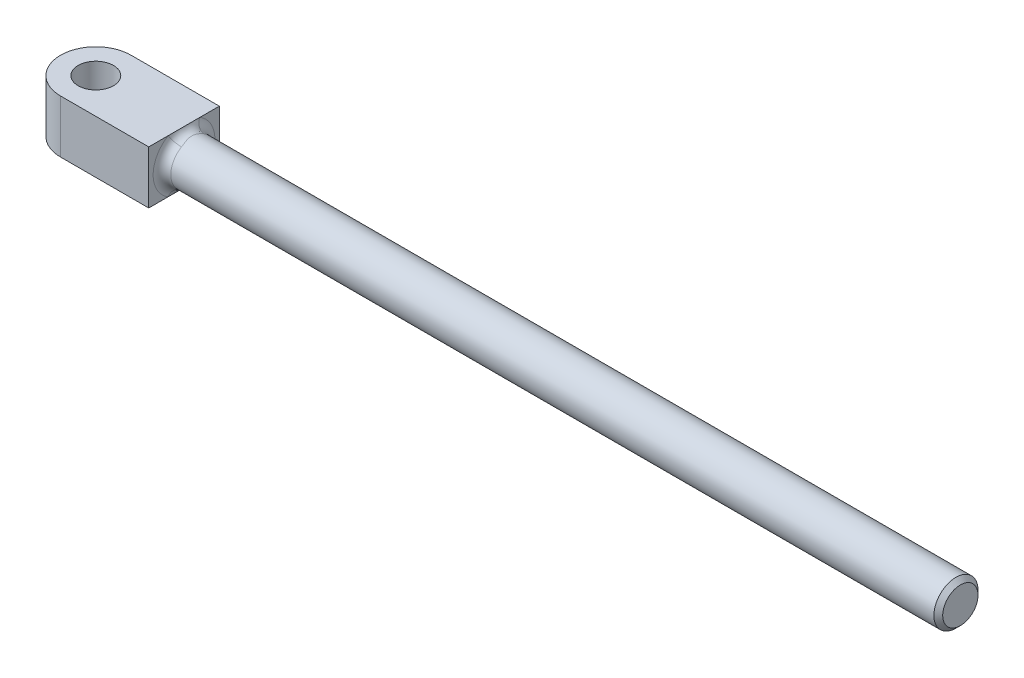
ISO-10303-21;
HEADER;
FILE_DESCRIPTION(('STEP AP214'),'2;1');
FILE_NAME('part.step','',(''),(''),'','','');
FILE_SCHEMA(('AUTOMOTIVE_DESIGN { 1 0 10303 214 1 1 1 1 }'));
ENDSEC;
DATA;
#1=APPLICATION_CONTEXT('core data for automotive mechanical design processes');
#2=APPLICATION_PROTOCOL_DEFINITION('international standard','automotive_design',2000,#1);
#3=PRODUCT_CONTEXT('',#1,'mechanical');
#4=PRODUCT('Part','Part','',(#3));
#5=PRODUCT_RELATED_PRODUCT_CATEGORY('part','',(#4));
#6=PRODUCT_DEFINITION_FORMATION('','',#4);
#7=PRODUCT_DEFINITION_CONTEXT('part definition',#1,'design');
#8=PRODUCT_DEFINITION('design','',#6,#7);
#9=PRODUCT_DEFINITION_SHAPE('','',#8);
#10=(LENGTH_UNIT() NAMED_UNIT(*) SI_UNIT(.MILLI.,.METRE.));
#11=(NAMED_UNIT(*) PLANE_ANGLE_UNIT() SI_UNIT($,.RADIAN.));
#12=(NAMED_UNIT(*) SI_UNIT($,.STERADIAN.) SOLID_ANGLE_UNIT());
#13=UNCERTAINTY_MEASURE_WITH_UNIT(LENGTH_MEASURE(1.E-05),#10,'distance_accuracy_value','');
#14=(GEOMETRIC_REPRESENTATION_CONTEXT(3) GLOBAL_UNCERTAINTY_ASSIGNED_CONTEXT((#13)) GLOBAL_UNIT_ASSIGNED_CONTEXT((#10,
#11,#12)) REPRESENTATION_CONTEXT('',''));
#15=CARTESIAN_POINT('',(0.,0.,0.));
#16=DIRECTION('',(0.,0.,1.));
#17=DIRECTION('',(1.,0.,0.));
#18=AXIS2_PLACEMENT_3D('',#15,#16,#17);
#19=CARTESIAN_POINT('',(-44.,3.,4.));
#20=DIRECTION('',(-1.,0.,0.));
#21=DIRECTION('',(0.,0.,1.));
#22=AXIS2_PLACEMENT_3D('',#19,#20,#21);
#23=PLANE('',#22);
#24=DIRECTION('',(0.,0.,-1.));
#25=VECTOR('',#24,1.);
#26=CARTESIAN_POINT('',(-44.,-3.,4.));
#27=LINE('',#26,#25);
#28=CARTESIAN_POINT('',(-44.,-3.,4.));
#29=VERTEX_POINT('',#28);
#30=CARTESIAN_POINT('',(-44.,-3.,1.802775637732));
#31=VERTEX_POINT('',#30);
#32=EDGE_CURVE('E249',#29,#31,#27,.T.);
#33=ORIENTED_EDGE('',*,*,#32,.T.);
#34=CARTESIAN_POINT('',(-44.,0.,0.));
#35=DIRECTION('',(-1.,0.,0.));
#36=DIRECTION('',(0.,0.,1.));
#37=AXIS2_PLACEMENT_3D('',#34,#35,#36);
#38=CIRCLE('',#37,3.5);
#39=CARTESIAN_POINT('',(-44.,3.,1.802775637732));
#40=VERTEX_POINT('',#39);
#41=EDGE_CURVE('E77',#31,#40,#38,.T.);
#42=ORIENTED_EDGE('',*,*,#41,.T.);
#43=DIRECTION('',(0.,0.,-1.));
#44=VECTOR('',#43,1.);
#45=CARTESIAN_POINT('',(-44.,3.,4.));
#46=LINE('',#45,#44);
#47=CARTESIAN_POINT('',(-44.,3.,4.));
#48=VERTEX_POINT('',#47);
#49=EDGE_CURVE('E129',#48,#40,#46,.T.);
#50=ORIENTED_EDGE('',*,*,#49,.F.);
#51=DIRECTION('',(0.,-1.,0.));
#52=VECTOR('',#51,1.);
#53=CARTESIAN_POINT('',(-44.,3.,4.));
#54=LINE('',#53,#52);
#55=EDGE_CURVE('E251',#48,#29,#54,.T.);
#56=ORIENTED_EDGE('',*,*,#55,.T.);
#57=EDGE_LOOP('',(#33,#42,#50,#56));
#58=FACE_BOUND('',#57,.T.);
#59=ADVANCED_FACE('F53',(#58),#23,.F.);
#60=CARTESIAN_POINT('',(44.,0.,0.));
#61=DIRECTION('',(-1.,0.,0.));
#62=DIRECTION('',(0.,0.,1.));
#63=AXIS2_PLACEMENT_3D('',#60,#61,#62);
#64=CYLINDRICAL_SURFACE('',#63,2.5);
#65=CARTESIAN_POINT('',(43.5,0.,0.));
#66=DIRECTION('',(1.,0.,0.));
#67=DIRECTION('',(0.,0.,-1.));
#68=AXIS2_PLACEMENT_3D('',#65,#66,#67);
#69=CIRCLE('',#68,2.5);
#70=CARTESIAN_POINT('',(43.5,0.,-2.5));
#71=VERTEX_POINT('',#70);
#72=EDGE_CURVE('E11',#71,#71,#69,.F.);
#73=ORIENTED_EDGE('',*,*,#72,.T.);
#74=EDGE_LOOP('',(#73));
#75=FACE_BOUND('',#74,.T.);
#76=CARTESIAN_POINT('',(-43.,0.,0.));
#77=DIRECTION('',(-1.,0.,0.));
#78=DIRECTION('',(0.,0.,1.));
#79=AXIS2_PLACEMENT_3D('',#76,#77,#78);
#80=CIRCLE('',#79,2.5);
#81=CARTESIAN_POINT('',(-43.,2.14285714285714,1.28769688409428));
#82=VERTEX_POINT('',#81);
#83=CARTESIAN_POINT('',(-43.,-2.14285714285714,1.28769688409428));
#84=VERTEX_POINT('',#83);
#85=EDGE_CURVE('E143',#82,#84,#80,.F.);
#86=ORIENTED_EDGE('',*,*,#85,.T.);
#87=CARTESIAN_POINT('',(-43.089797118085,-1.84702666727615,1.68478262407076));
#88=CARTESIAN_POINT('',(-44.4013055840775,-2.11805305184009,1.38765648288615));
#89=CARTESIAN_POINT('',(-44.,-3.,2.35869567369906));
#90=CARTESIAN_POINT('',(-43.0750365677151,-1.87021882017819,1.65936827293121));
#91=CARTESIAN_POINT('',(-44.3701378909476,-2.10409965880878,1.39485788528736));
#92=CARTESIAN_POINT('',(-44.,-3.,2.32311558212301));
#93=CARTESIAN_POINT('',(-43.0624960551256,-1.8931706547633,1.6331408793853));
#94=CARTESIAN_POINT('',(-44.3378304890208,-2.09472768310196,1.39873123079867));
#95=CARTESIAN_POINT('',(-44.,-3.,2.28639723116133));
#96=CARTESIAN_POINT('',(-43.0413121648804,-1.93827997476055,1.57933264082472));
#97=CARTESIAN_POINT('',(-44.2739687568214,-2.08398106756867,1.39974119365739));
#98=CARTESIAN_POINT('',(-44.,-3.,2.21106569716945));
#99=CARTESIAN_POINT('',(-43.0326604969719,-1.96043905638494,1.55175481528734));
#100=CARTESIAN_POINT('',(-44.2424003619311,-2.08237228525282,1.39707606759514));
#101=CARTESIAN_POINT('',(-44.,-3.,2.1724567414075));
#102=CARTESIAN_POINT('',(-43.0118107698363,-2.02490711609745,1.46788389797563));
#103=CARTESIAN_POINT('',(-44.153160239198,-2.08663625544711,1.38007393620703));
#104=CARTESIAN_POINT('',(-44.,-3.,2.05503745715556));
#105=CARTESIAN_POINT('',(-43.00440526438,-2.06575259890433,1.40985814870029));
#106=CARTESIAN_POINT('',(-44.0973752365874,-2.10056168474141,1.35734706621002));
#107=CARTESIAN_POINT('',(-44.,-3.,1.97380140817702));
#108=CARTESIAN_POINT('',(-42.996699571837,-2.166530781852,1.25280520925141));
#109=CARTESIAN_POINT('',(-43.971793247003,-2.1515106641981,1.27354998841386));
#110=CARTESIAN_POINT('',(-44.,-3.,1.75392729295748));
#111=CARTESIAN_POINT('',(-43.0038144970095,-2.222277809081,1.15097658677615));
#112=CARTESIAN_POINT('',(-43.9094620246063,-2.19733566368005,1.19776380716156));
#113=CARTESIAN_POINT('',(-44.,-3.,1.6113672214882));
#114=CARTESIAN_POINT('',(-43.0285142350657,-2.31925618416504,0.940546919485241));
#115=CARTESIAN_POINT('',(-43.8178292510465,-2.28776397044254,1.01589565420033));
#116=CARTESIAN_POINT('',(-44.,-3.,1.31676568727773));
#117=CARTESIAN_POINT('',(-43.0461778500175,-2.36037452380379,0.831900466571021));
#118=CARTESIAN_POINT('',(-43.7862845207067,-2.3331242401296,0.90981205141224));
#119=CARTESIAN_POINT('',(-44.,-3.,1.16466065319858));
#120=CARTESIAN_POINT('',(-43.0731582535501,-2.41171212801429,0.661443155926692));
#121=CARTESIAN_POINT('',(-43.7528917245329,-2.39215410620667,0.732933207563454));
#122=CARTESIAN_POINT('',(-44.,-3.,0.926020418297826));
#123=CARTESIAN_POINT('',(-43.0825522109005,-2.42742237789651,0.601243759095335));
#124=CARTESIAN_POINT('',(-43.7439634770233,-2.41075944684108,0.669088597459993));
#125=CARTESIAN_POINT('',(-44.,-3.,0.841741262734412));
#126=CARTESIAN_POINT('',(-43.0998403341181,-2.45432605473146,0.479742938974889));
#127=CARTESIAN_POINT('',(-43.7300358645077,-2.443038608103,0.538014598545577));
#128=CARTESIAN_POINT('',(-44.,-3.,0.671640114565408));
#129=CARTESIAN_POINT('',(-43.1077350515484,-2.46552114449967,0.418441930084279));
#130=CARTESIAN_POINT('',(-43.7249453148161,-2.45686188645873,0.470525326937753));
#131=CARTESIAN_POINT('',(-44.,-3.,0.585818702117689));
#132=CARTESIAN_POINT('',(-43.1207588796569,-2.48327432263301,0.295297174727497));
#133=CARTESIAN_POINT('',(-43.7174407917484,-2.47886682684453,0.333738205015865));
#134=CARTESIAN_POINT('',(-44.,-3.,0.413416044618795));
#135=CARTESIAN_POINT('',(-43.1259001064712,-2.48985276592177,0.233457043445522));
#136=CARTESIAN_POINT('',(-43.7149720886307,-2.48717845577119,0.264142380679048));
#137=CARTESIAN_POINT('',(-44.,-3.,0.326839860825487));
#138=CARTESIAN_POINT('',(-43.1326423774325,-2.49838093998099,0.109361414969603));
#139=CARTESIAN_POINT('',(-43.7118654798941,-2.49792896303268,0.124128201815217));
#140=CARTESIAN_POINT('',(-44.,-3.,0.153105980955885));
#141=CARTESIAN_POINT('',(-43.134243770003,-2.50033112630897,0.0471059592608403));
#142=CARTESIAN_POINT('',(-43.7112114325808,-2.5004215525342,0.0533690862009662));
#143=CARTESIAN_POINT('',(-44.,-3.,0.0659483429588452));
#144=CARTESIAN_POINT('',(-43.1336139067538,-2.49955575223616,-0.0809249677260562));
#145=CARTESIAN_POINT('',(-43.7114774751147,-2.4994348313836,-0.0917267287857017));
#146=CARTESIAN_POINT('',(-44.,-3.,-0.113294954809786));
#147=CARTESIAN_POINT('',(-43.1311586456095,-2.49655692159848,-0.146698507289078));
#148=CARTESIAN_POINT('',(-43.7124911460776,-2.49560052172952,-0.166438542504366));
#149=CARTESIAN_POINT('',(-44.,-3.,-0.205377910178918));
#150=CARTESIAN_POINT('',(-43.1224512074842,-2.48540146107993,-0.277672408532134));
#151=CARTESIAN_POINT('',(-43.716666788324,-2.48158959625074,-0.313859143066459));
#152=CARTESIAN_POINT('',(-44.,-3.,-0.388741371970783));
#153=CARTESIAN_POINT('',(-43.1161982583954,-2.47724378233975,-0.342872650919777));
#154=CARTESIAN_POINT('',(-43.7198536950069,-2.4713346985524,-0.386964129925139));
#155=CARTESIAN_POINT('',(-44.,-3.,-0.480021711384188));
#156=CARTESIAN_POINT('',(-43.0932464010228,-2.44504355931936,-0.537749623298525));
#157=CARTESIAN_POINT('',(-43.7342534174093,-2.4313991285767,-0.603266803000702));
#158=CARTESIAN_POINT('',(-44.,-3.,-0.752849472792719));
#159=CARTESIAN_POINT('',(-43.0723789849322,-2.4132798538366,-0.665936276663989));
#160=CARTESIAN_POINT('',(-43.7505706277765,-2.39210640783796,-0.74218606897693));
#161=CARTESIAN_POINT('',(-44.,-3.,-0.932310787375758));
#162=CARTESIAN_POINT('',(-43.0325989277867,-2.32918194316108,-0.918065057160666));
#163=CARTESIAN_POINT('',(-43.8098708915164,-2.29892237927612,-0.995192101211795));
#164=CARTESIAN_POINT('',(-44.,-3.,-1.28529107997799));
#165=CARTESIAN_POINT('',(-43.01372459553,-2.27651421506208,-1.04190105099424));
#166=CARTESIAN_POINT('',(-43.8552965844584,-2.24305314597982,-1.11025639067921));
#167=CARTESIAN_POINT('',(-44.,-3.,-1.45866147138325));
#168=CARTESIAN_POINT('',(-43.0006561131893,-2.18316948515406,-1.21991874616671));
#169=CARTESIAN_POINT('',(-43.9527001394436,-2.16884641960792,-1.24485988487911));
#170=CARTESIAN_POINT('',(-44.,-3.,-1.70788624463769));
#171=CARTESIAN_POINT('',(-42.9988115884042,-2.14987102325299,-1.27769153842259));
#172=CARTESIAN_POINT('',(-43.9914812930602,-2.14508379161499,-1.28423049414727));
#173=CARTESIAN_POINT('',(-44.,-3.,-1.78876815379298));
#174=CARTESIAN_POINT('',(-43.0027809524236,-2.07884509209169,-1.3902589940265));
#175=CARTESIAN_POINT('',(-44.0802128203743,-2.10631330259421,-1.34781643223736));
#176=CARTESIAN_POINT('',(-44.,-3.,-1.94636259163618));
#177=CARTESIAN_POINT('',(-43.0085821638041,-2.04112504867186,-1.44505843077802));
#178=CARTESIAN_POINT('',(-44.1308276829839,-2.09160274518386,-1.37150981875896));
#179=CARTESIAN_POINT('',(-44.,-3.,-2.02308180308899));
#180=CARTESIAN_POINT('',(-43.0287135788627,-1.96987321995234,-1.54025161223538));
#181=CARTESIAN_POINT('',(-44.2293462180589,-2.081200774338,-1.39659640419796));
#182=CARTESIAN_POINT('',(-44.,-3.,-2.15635225712972));
#183=CARTESIAN_POINT('',(-43.0411101719168,-1.93700833370553,-1.5813374440865));
#184=CARTESIAN_POINT('',(-44.2764809877482,-2.08277430752351,-1.40104255573381));
#185=CARTESIAN_POINT('',(-44.,-3.,-2.2138724217212));
#186=CARTESIAN_POINT('',(-43.0748140684746,-1.86941106524605,-1.66075648332887));
#187=CARTESIAN_POINT('',(-44.3718312861369,-2.10297416756328,-1.39609191158888));
#188=CARTESIAN_POINT('',(-44.,-3.,-2.32505907666032));
#189=CARTESIAN_POINT('',(-43.0962198088155,-1.83466186451647,-1.69905362584829));
#190=CARTESIAN_POINT('',(-44.4200246778576,-2.12254536468005,-1.38591811782259));
#191=CARTESIAN_POINT('',(-44.,-3.,-2.37867507618741));
#192=CARTESIAN_POINT('',(-43.1230308972261,-1.79960945399659,-1.73534025859083));
#193=CARTESIAN_POINT('',(-44.4637953692633,-2.15360119143181,-1.36823825990707));
#194=CARTESIAN_POINT('',(-44.,-3.,-2.42947636202717));
#195=(BOUNDED_SURFACE() B_SPLINE_SURFACE(3,2,((#87,#88,#89),(#90,#91,#92),(#93,#94,#95),(#96,
#97,#98),(#99,#100,#101),(#102,#103,#104),(#105,#106,#107),(#108,#109,#110),(#111,#112,#113),
(#114,#115,#116),(#117,#118,#119),(#120,#121,#122),(#123,#124,#125),(#126,#127,#128),(#129,#130,
#131),(#132,#133,#134),(#135,#136,#137),(#138,#139,#140),(#141,#142,#143),(#144,#145,#146),
(#147,#148,#149),(#150,#151,#152),(#153,#154,#155),(#156,#157,#158),(#159,#160,#161),(#162,#163,
#164),(#165,#166,#167),(#168,#169,#170),(#171,#172,#173),(#174,#175,#176),(#177,#178,#179),
(#180,#181,#182),(#183,#184,#185),(#186,#187,#188),(#189,#190,#191),(#192,#193,#194)),
.UNSPECIFIED.,.F.,.F.,.F.) B_SPLINE_SURFACE_WITH_KNOTS((4,2,2,2,2,2,2,2,2,2,2,2,2,2,2,2,2,4),(3,
3),(0.,0.150978452111827,0.301633503365177,0.599468504271155,1.08493079559653,1.57406582227361,
1.83667758241673,2.09919254100671,2.36054266600821,2.62186706535215,2.8981091770013,
3.17440747024344,3.73017973784791,4.29520076320607,4.57485505395896,4.85404623174449,
5.07750820983562,5.30347792971453),(0.,1.),
.UNSPECIFIED.) GEOMETRIC_REPRESENTATION_ITEM() RATIONAL_B_SPLINE_SURFACE(((1.,0.589072238635042,
1.),(1.,0.59762198167987,1.),(1.,0.606281072137651,1.),(1.,0.623622640940451,1.),(1.,
0.632305029457278,1.),(1.,0.657952795370197,1.),(1.,0.674723639585426,1.),(1.,0.716899899837881,
1.),(1.,0.741089115601713,1.),(1.,0.783806931119421,1.),(1.,0.80229132133743,1.),(1.,
0.825548340664818,1.),(1.,0.832706660558896,1.),(1.,0.84500393829057,1.),(1.,0.85014363951437,
1.),(1.,0.858307963303755,1.),(1.,0.861341869719556,1.),(1.,0.865276991795518,1.),(1.,
0.866178417354906,1.),(1.,0.865820137657809,1.),(1.,0.864434126698027,1.),(1.,0.859289909346189,
1.),(1.,0.855531220558886,1.),(1.,0.840741031559034,1.),(1.,0.826198716210332,1.),(1.,
0.788270185201532,1.),(1.,0.764740823018135,1.),(1.,0.724264523444217,1.),(1.,0.709994983454132,
1.),(1.,0.680153160391977,1.),(1.,0.66458307382069,1.),(1.,0.635979859402365,1.),(1.,
0.623060704128199,1.),(1.,0.597254296383167,1.),(1.,0.584369028951344,1.),(1.,0.571874723989388,1.))) REPRESENTATION_ITEM('') SURFACE());
#196=CARTESIAN_POINT('',(-43.089797118085,-1.84702666727615,1.68478262407076));
#197=CARTESIAN_POINT('',(-43.0750365677151,-1.87021882017819,1.65936827293121));
#198=CARTESIAN_POINT('',(-43.0624960551256,-1.8931706547633,1.6331408793853));
#199=CARTESIAN_POINT('',(-43.0413121648804,-1.93827997476055,1.57933264082472));
#200=CARTESIAN_POINT('',(-43.0326604969719,-1.96043905638494,1.55175481528734));
#201=CARTESIAN_POINT('',(-43.0118107698362,-2.02490711609745,1.46788389797563));
#202=CARTESIAN_POINT('',(-43.00440526438,-2.06575259890433,1.40985814870029));
#203=CARTESIAN_POINT('',(-42.996699571837,-2.166530781852,1.25280520925141));
#204=CARTESIAN_POINT('',(-43.0038144970095,-2.222277809081,1.15097658677615));
#205=CARTESIAN_POINT('',(-43.0285142350657,-2.31925618416504,0.940546919485241));
#206=CARTESIAN_POINT('',(-43.0461778500175,-2.36037452380379,0.831900466571021));
#207=CARTESIAN_POINT('',(-43.0731582535501,-2.41171212801429,0.661443155926692));
#208=CARTESIAN_POINT('',(-43.0825522109005,-2.42742237789651,0.601243759095335));
#209=CARTESIAN_POINT('',(-43.0998403341181,-2.45432605473146,0.479742938974889));
#210=CARTESIAN_POINT('',(-43.1077350515484,-2.46552114449967,0.418441930084279));
#211=CARTESIAN_POINT('',(-43.1207588796569,-2.48327432263301,0.295297174727497));
#212=CARTESIAN_POINT('',(-43.1259001064712,-2.48985276592177,0.233457043445522));
#213=CARTESIAN_POINT('',(-43.1326423774325,-2.49838093998099,0.109361414969603));
#214=CARTESIAN_POINT('',(-43.134243770003,-2.50033112630897,0.0471059592608402));
#215=CARTESIAN_POINT('',(-43.1336139067538,-2.49955575223616,-0.0809249677260563));
#216=CARTESIAN_POINT('',(-43.1311586456095,-2.49655692159848,-0.146698507289078));
#217=CARTESIAN_POINT('',(-43.1224512074842,-2.48540146107993,-0.277672408532134));
#218=CARTESIAN_POINT('',(-43.1161982583954,-2.47724378233976,-0.342872650919777));
#219=CARTESIAN_POINT('',(-43.0932464010228,-2.44504355931936,-0.537749623298525));
#220=CARTESIAN_POINT('',(-43.0723789849322,-2.4132798538366,-0.665936276663989));
#221=CARTESIAN_POINT('',(-43.0325989277867,-2.32918194316108,-0.918065057160667));
#222=CARTESIAN_POINT('',(-43.01372459553,-2.27651421506208,-1.04190105099424));
#223=CARTESIAN_POINT('',(-43.0006561131893,-2.18316948515406,-1.21991874616671));
#224=CARTESIAN_POINT('',(-42.9988115884042,-2.14987102325299,-1.27769153842259));
#225=CARTESIAN_POINT('',(-43.0027809524236,-2.07884509209169,-1.3902589940265));
#226=CARTESIAN_POINT('',(-43.0085821638041,-2.04112504867186,-1.44505843077802));
#227=CARTESIAN_POINT('',(-43.0287135788627,-1.96987321995234,-1.54025161223538));
#228=CARTESIAN_POINT('',(-43.0411101719168,-1.93700833370553,-1.5813374440865));
#229=CARTESIAN_POINT('',(-43.0748140684746,-1.86941106524605,-1.66075648332887));
#230=CARTESIAN_POINT('',(-43.0962198088155,-1.83466186451647,-1.69905362584829));
#231=CARTESIAN_POINT('',(-43.1230308972261,-1.79960945399659,-1.73534025859083));
#232=B_SPLINE_CURVE_WITH_KNOTS('',3,(#196,#197,#198,#199,#200,#201,#202,#203,#204,#205,#206,
#207,#208,#209,#210,#211,#212,#213,#214,#215,#216,#217,#218,#219,#220,#221,#222,#223,#224,#225,
#226,#227,#228,#229,#230,#231),.UNSPECIFIED.,.F.,.F.,(4,2,2,2,2,2,2,2,2,2,2,2,2,2,2,2,2,4),(0.,
0.150978452111827,0.301633503365177,0.599468504271155,1.08493079559653,1.57406582227361,
1.83667758241673,2.09919254100671,2.36054266600821,2.62186706535215,2.8981091770013,
3.17440747024344,3.73017973784791,4.29520076320607,4.57485505395896,4.85404623174449,
5.07750820983562,5.30347792971453),.UNSPECIFIED.);
#233=CARTESIAN_POINT('',(-43.,-2.14285714285714,-1.28769688409428));
#234=VERTEX_POINT('',#233);
#235=EDGE_CURVE('E197',#84,#234,#232,.T.);
#236=ORIENTED_EDGE('',*,*,#235,.T.);
#237=CARTESIAN_POINT('',(-43.,0.,0.));
#238=DIRECTION('',(-1.,0.,0.));
#239=DIRECTION('',(0.,0.,1.));
#240=AXIS2_PLACEMENT_3D('',#237,#238,#239);
#241=CIRCLE('',#240,2.5);
#242=CARTESIAN_POINT('',(-43.,2.14285714285714,-1.28769688409428));
#243=VERTEX_POINT('',#242);
#244=EDGE_CURVE('E158',#234,#243,#241,.F.);
#245=ORIENTED_EDGE('',*,*,#244,.T.);
#246=CARTESIAN_POINT('',(-43.089797118085,1.84702666727615,-1.68478262407076));
#247=CARTESIAN_POINT('',(-44.4013055840775,2.11805305184009,-1.38765648288615));
#248=CARTESIAN_POINT('',(-44.,3.,-2.35869567369906));
#249=CARTESIAN_POINT('',(-43.0750365677151,1.87021882017819,-1.65936827293121));
#250=CARTESIAN_POINT('',(-44.3701378909476,2.10409965880878,-1.39485788528736));
#251=CARTESIAN_POINT('',(-44.,3.,-2.323115582123));
#252=CARTESIAN_POINT('',(-43.0624960551256,1.8931706547633,-1.6331408793853));
#253=CARTESIAN_POINT('',(-44.3378304890208,2.09472768310196,-1.39873123079867));
#254=CARTESIAN_POINT('',(-44.,3.,-2.28639723116133));
#255=CARTESIAN_POINT('',(-43.0413121648804,1.93827997476055,-1.57933264082472));
#256=CARTESIAN_POINT('',(-44.2739687568214,2.08398106756867,-1.39974119365739));
#257=CARTESIAN_POINT('',(-44.,3.,-2.21106569716945));
#258=CARTESIAN_POINT('',(-43.0326604969719,1.96043905638494,-1.55175481528734));
#259=CARTESIAN_POINT('',(-44.2424003619311,2.08237228525282,-1.39707606759514));
#260=CARTESIAN_POINT('',(-44.,3.,-2.1724567414075));
#261=CARTESIAN_POINT('',(-43.0118107698363,2.02490711609745,-1.46788389797563));
#262=CARTESIAN_POINT('',(-44.153160239198,2.08663625544711,-1.38007393620703));
#263=CARTESIAN_POINT('',(-44.,3.,-2.05503745715557));
#264=CARTESIAN_POINT('',(-43.00440526438,2.06575259890433,-1.40985814870029));
#265=CARTESIAN_POINT('',(-44.0973752365874,2.10056168474141,-1.35734706621002));
#266=CARTESIAN_POINT('',(-44.,3.,-1.97380140817702));
#267=CARTESIAN_POINT('',(-42.996699571837,2.166530781852,-1.25280520925141));
#268=CARTESIAN_POINT('',(-43.971793247003,2.1515106641981,-1.27354998841386));
#269=CARTESIAN_POINT('',(-44.,3.,-1.75392729295748));
#270=CARTESIAN_POINT('',(-43.0038144970095,2.222277809081,-1.15097658677615));
#271=CARTESIAN_POINT('',(-43.9094620246063,2.19733566368005,-1.19776380716156));
#272=CARTESIAN_POINT('',(-44.,3.,-1.6113672214882));
#273=CARTESIAN_POINT('',(-43.0285142350657,2.31925618416504,-0.940546919485241));
#274=CARTESIAN_POINT('',(-43.8178292510465,2.28776397044254,-1.01589565420033));
#275=CARTESIAN_POINT('',(-44.,3.,-1.31676568727773));
#276=CARTESIAN_POINT('',(-43.0461778500175,2.36037452380379,-0.831900466571021));
#277=CARTESIAN_POINT('',(-43.7862845207067,2.3331242401296,-0.90981205141224));
#278=CARTESIAN_POINT('',(-44.,3.,-1.16466065319858));
#279=CARTESIAN_POINT('',(-43.0731582535501,2.41171212801429,-0.661443155926692));
#280=CARTESIAN_POINT('',(-43.7528917245329,2.39215410620667,-0.732933207563455));
#281=CARTESIAN_POINT('',(-44.,3.,-0.926020418297826));
#282=CARTESIAN_POINT('',(-43.0825522109005,2.42742237789651,-0.601243759095335));
#283=CARTESIAN_POINT('',(-43.7439634770233,2.41075944684108,-0.669088597459993));
#284=CARTESIAN_POINT('',(-44.,3.,-0.841741262734412));
#285=CARTESIAN_POINT('',(-43.0998403341181,2.45432605473146,-0.479742938974889));
#286=CARTESIAN_POINT('',(-43.7300358645077,2.443038608103,-0.538014598545577));
#287=CARTESIAN_POINT('',(-44.,3.,-0.671640114565408));
#288=CARTESIAN_POINT('',(-43.1077350515484,2.46552114449967,-0.418441930084279));
#289=CARTESIAN_POINT('',(-43.7249453148161,2.45686188645873,-0.470525326937753));
#290=CARTESIAN_POINT('',(-44.,3.,-0.585818702117689));
#291=CARTESIAN_POINT('',(-43.1207588796569,2.48327432263301,-0.295297174727497));
#292=CARTESIAN_POINT('',(-43.7174407917484,2.47886682684453,-0.333738205015865));
#293=CARTESIAN_POINT('',(-44.,3.,-0.413416044618796));
#294=CARTESIAN_POINT('',(-43.1259001064712,2.48985276592177,-0.233457043445522));
#295=CARTESIAN_POINT('',(-43.7149720886307,2.48717845577119,-0.264142380679048));
#296=CARTESIAN_POINT('',(-44.,3.,-0.326839860825487));
#297=CARTESIAN_POINT('',(-43.1326423774325,2.49838093998099,-0.109361414969603));
#298=CARTESIAN_POINT('',(-43.7118654798941,2.49792896303268,-0.124128201815217));
#299=CARTESIAN_POINT('',(-44.,3.,-0.153105980955885));
#300=CARTESIAN_POINT('',(-43.134243770003,2.50033112630897,-0.0471059592608403));
#301=CARTESIAN_POINT('',(-43.7112114325808,2.5004215525342,-0.0533690862009662));
#302=CARTESIAN_POINT('',(-44.,3.,-0.0659483429588452));
#303=CARTESIAN_POINT('',(-43.1336139067538,2.49955575223616,0.0809249677260562));
#304=CARTESIAN_POINT('',(-43.7114774751147,2.4994348313836,0.0917267287857017));
#305=CARTESIAN_POINT('',(-44.,3.,0.113294954809786));
#306=CARTESIAN_POINT('',(-43.1311586456095,2.49655692159848,0.146698507289078));
#307=CARTESIAN_POINT('',(-43.7124911460776,2.49560052172952,0.166438542504366));
#308=CARTESIAN_POINT('',(-44.,3.,0.205377910178918));
#309=CARTESIAN_POINT('',(-43.1224512074842,2.48540146107993,0.277672408532134));
#310=CARTESIAN_POINT('',(-43.716666788324,2.48158959625074,0.313859143066459));
#311=CARTESIAN_POINT('',(-44.,3.,0.388741371970783));
#312=CARTESIAN_POINT('',(-43.1161982583954,2.47724378233975,0.342872650919777));
#313=CARTESIAN_POINT('',(-43.7198536950069,2.4713346985524,0.386964129925139));
#314=CARTESIAN_POINT('',(-44.,3.,0.480021711384188));
#315=CARTESIAN_POINT('',(-43.0932464010228,2.44504355931936,0.537749623298525));
#316=CARTESIAN_POINT('',(-43.7342534174093,2.4313991285767,0.603266803000702));
#317=CARTESIAN_POINT('',(-44.,3.,0.752849472792719));
#318=CARTESIAN_POINT('',(-43.0723789849322,2.4132798538366,0.665936276663989));
#319=CARTESIAN_POINT('',(-43.7505706277765,2.39210640783796,0.742186068976931));
#320=CARTESIAN_POINT('',(-44.,3.,0.932310787375759));
#321=CARTESIAN_POINT('',(-43.0325989277867,2.32918194316108,0.918065057160666));
#322=CARTESIAN_POINT('',(-43.8098708915164,2.29892237927612,0.995192101211795));
#323=CARTESIAN_POINT('',(-44.,3.,1.28529107997799));
#324=CARTESIAN_POINT('',(-43.01372459553,2.27651421506208,1.04190105099424));
#325=CARTESIAN_POINT('',(-43.8552965844584,2.24305314597982,1.11025639067921));
#326=CARTESIAN_POINT('',(-44.,3.,1.45866147138325));
#327=CARTESIAN_POINT('',(-43.0006561131893,2.18316948515406,1.21991874616671));
#328=CARTESIAN_POINT('',(-43.9527001394436,2.16884641960792,1.24485988487911));
#329=CARTESIAN_POINT('',(-44.,3.,1.70788624463769));
#330=CARTESIAN_POINT('',(-42.9988115884042,2.14987102325299,1.27769153842259));
#331=CARTESIAN_POINT('',(-43.9914812930602,2.14508379161499,1.28423049414727));
#332=CARTESIAN_POINT('',(-44.,3.,1.78876815379298));
#333=CARTESIAN_POINT('',(-43.0027809524236,2.07884509209169,1.3902589940265));
#334=CARTESIAN_POINT('',(-44.0802128203743,2.10631330259421,1.34781643223736));
#335=CARTESIAN_POINT('',(-44.,3.,1.94636259163618));
#336=CARTESIAN_POINT('',(-43.0085821638041,2.04112504867186,1.44505843077802));
#337=CARTESIAN_POINT('',(-44.1308276829839,2.09160274518386,1.37150981875896));
#338=CARTESIAN_POINT('',(-44.,3.,2.02308180308899));
#339=CARTESIAN_POINT('',(-43.0287135788627,1.96987321995234,1.54025161223538));
#340=CARTESIAN_POINT('',(-44.2293462180589,2.081200774338,1.39659640419796));
#341=CARTESIAN_POINT('',(-44.,3.,2.15635225712972));
#342=CARTESIAN_POINT('',(-43.0411101719168,1.93700833370553,1.5813374440865));
#343=CARTESIAN_POINT('',(-44.2764809877482,2.08277430752351,1.40104255573381));
#344=CARTESIAN_POINT('',(-44.,3.,2.2138724217212));
#345=CARTESIAN_POINT('',(-43.0748140684746,1.86941106524605,1.66075648332887));
#346=CARTESIAN_POINT('',(-44.3718312861369,2.10297416756328,1.39609191158888));
#347=CARTESIAN_POINT('',(-44.,3.,2.32505907666032));
#348=CARTESIAN_POINT('',(-43.0962198088155,1.83466186451647,1.69905362584829));
#349=CARTESIAN_POINT('',(-44.4200246778576,2.12254536468005,1.38591811782259));
#350=CARTESIAN_POINT('',(-44.,3.,2.37867507618741));
#351=CARTESIAN_POINT('',(-43.1230308972261,1.79960945399659,1.73534025859083));
#352=CARTESIAN_POINT('',(-44.4637953692633,2.15360119143181,1.36823825990707));
#353=CARTESIAN_POINT('',(-44.,3.,2.42947636202717));
#354=(BOUNDED_SURFACE() B_SPLINE_SURFACE(3,2,((#246,#247,#248),(#249,#250,#251),(#252,#253,
#254),(#255,#256,#257),(#258,#259,#260),(#261,#262,#263),(#264,#265,#266),(#267,#268,#269),
(#270,#271,#272),(#273,#274,#275),(#276,#277,#278),(#279,#280,#281),(#282,#283,#284),(#285,#286,
#287),(#288,#289,#290),(#291,#292,#293),(#294,#295,#296),(#297,#298,#299),(#300,#301,#302),
(#303,#304,#305),(#306,#307,#308),(#309,#310,#311),(#312,#313,#314),(#315,#316,#317),(#318,#319,
#320),(#321,#322,#323),(#324,#325,#326),(#327,#328,#329),(#330,#331,#332),(#333,#334,#335),
(#336,#337,#338),(#339,#340,#341),(#342,#343,#344),(#345,#346,#347),(#348,#349,#350),(#351,#352,
#353)),.UNSPECIFIED.,.F.,.F.,.F.) B_SPLINE_SURFACE_WITH_KNOTS((4,2,2,2,2,2,2,2,2,2,2,2,2,2,2,2,
2,4),(3,3),(0.,0.150978452111827,0.301633503365177,0.599468504271155,1.08493079559653,
1.57406582227361,1.83667758241673,2.09919254100671,2.36054266600821,2.62186706535215,
2.8981091770013,3.17440747024344,3.73017973784791,4.29520076320607,4.57485505395896,
4.85404623174449,5.07750820983562,5.30347792971453),(0.,1.),
.UNSPECIFIED.) GEOMETRIC_REPRESENTATION_ITEM() RATIONAL_B_SPLINE_SURFACE(((1.,0.589072238635042,
1.),(1.,0.59762198167987,1.),(1.,0.606281072137652,1.),(1.,0.623622640940451,1.),(1.,
0.632305029457278,1.),(1.,0.657952795370197,1.),(1.,0.674723639585426,1.),(1.,0.716899899837881,
1.),(1.,0.741089115601713,1.),(1.,0.783806931119421,1.),(1.,0.80229132133743,1.),(1.,
0.825548340664818,1.),(1.,0.832706660558896,1.),(1.,0.84500393829057,1.),(1.,0.85014363951437,
1.),(1.,0.858307963303755,1.),(1.,0.861341869719556,1.),(1.,0.865276991795518,1.),(1.,
0.866178417354906,1.),(1.,0.865820137657809,1.),(1.,0.864434126698027,1.),(1.,0.859289909346189,
1.),(1.,0.855531220558886,1.),(1.,0.840741031559034,1.),(1.,0.826198716210332,1.),(1.,
0.788270185201532,1.),(1.,0.764740823018135,1.),(1.,0.724264523444217,1.),(1.,0.709994983454132,
1.),(1.,0.680153160391977,1.),(1.,0.66458307382069,1.),(1.,0.635979859402365,1.),(1.,
0.623060704128199,1.),(1.,0.597254296383167,1.),(1.,0.584369028951344,1.),(1.,0.571874723989388,1.))) REPRESENTATION_ITEM('') SURFACE());
#355=CARTESIAN_POINT('',(-43.089797118085,1.84702666727615,-1.68478262407076));
#356=CARTESIAN_POINT('',(-43.0750365677151,1.87021882017819,-1.65936827293121));
#357=CARTESIAN_POINT('',(-43.0624960551256,1.8931706547633,-1.6331408793853));
#358=CARTESIAN_POINT('',(-43.0413121648804,1.93827997476055,-1.57933264082472));
#359=CARTESIAN_POINT('',(-43.0326604969719,1.96043905638494,-1.55175481528734));
#360=CARTESIAN_POINT('',(-43.0118107698362,2.02490711609745,-1.46788389797563));
#361=CARTESIAN_POINT('',(-43.00440526438,2.06575259890433,-1.40985814870029));
#362=CARTESIAN_POINT('',(-42.996699571837,2.166530781852,-1.25280520925141));
#363=CARTESIAN_POINT('',(-43.0038144970095,2.222277809081,-1.15097658677615));
#364=CARTESIAN_POINT('',(-43.0285142350657,2.31925618416504,-0.940546919485241));
#365=CARTESIAN_POINT('',(-43.0461778500175,2.36037452380379,-0.831900466571021));
#366=CARTESIAN_POINT('',(-43.0731582535501,2.41171212801429,-0.661443155926692));
#367=CARTESIAN_POINT('',(-43.0825522109005,2.42742237789651,-0.601243759095335));
#368=CARTESIAN_POINT('',(-43.0998403341181,2.45432605473146,-0.479742938974889));
#369=CARTESIAN_POINT('',(-43.1077350515484,2.46552114449967,-0.418441930084279));
#370=CARTESIAN_POINT('',(-43.1207588796569,2.48327432263301,-0.295297174727497));
#371=CARTESIAN_POINT('',(-43.1259001064712,2.48985276592177,-0.233457043445522));
#372=CARTESIAN_POINT('',(-43.1326423774325,2.49838093998099,-0.109361414969603));
#373=CARTESIAN_POINT('',(-43.134243770003,2.50033112630897,-0.0471059592608402));
#374=CARTESIAN_POINT('',(-43.1336139067538,2.49955575223616,0.0809249677260563));
#375=CARTESIAN_POINT('',(-43.1311586456095,2.49655692159848,0.146698507289078));
#376=CARTESIAN_POINT('',(-43.1224512074842,2.48540146107993,0.277672408532134));
#377=CARTESIAN_POINT('',(-43.1161982583954,2.47724378233976,0.342872650919777));
#378=CARTESIAN_POINT('',(-43.0932464010228,2.44504355931936,0.537749623298525));
#379=CARTESIAN_POINT('',(-43.0723789849322,2.4132798538366,0.665936276663989));
#380=CARTESIAN_POINT('',(-43.0325989277867,2.32918194316108,0.918065057160667));
#381=CARTESIAN_POINT('',(-43.01372459553,2.27651421506208,1.04190105099424));
#382=CARTESIAN_POINT('',(-43.0006561131893,2.18316948515406,1.21991874616671));
#383=CARTESIAN_POINT('',(-42.9988115884042,2.14987102325299,1.27769153842259));
#384=CARTESIAN_POINT('',(-43.0027809524236,2.07884509209169,1.3902589940265));
#385=CARTESIAN_POINT('',(-43.0085821638041,2.04112504867186,1.44505843077802));
#386=CARTESIAN_POINT('',(-43.0287135788627,1.96987321995234,1.54025161223538));
#387=CARTESIAN_POINT('',(-43.0411101719168,1.93700833370553,1.5813374440865));
#388=CARTESIAN_POINT('',(-43.0748140684746,1.86941106524605,1.66075648332887));
#389=CARTESIAN_POINT('',(-43.0962198088155,1.83466186451647,1.69905362584829));
#390=CARTESIAN_POINT('',(-43.1230308972261,1.79960945399659,1.73534025859083));
#391=B_SPLINE_CURVE_WITH_KNOTS('',3,(#355,#356,#357,#358,#359,#360,#361,#362,#363,#364,#365,
#366,#367,#368,#369,#370,#371,#372,#373,#374,#375,#376,#377,#378,#379,#380,#381,#382,#383,#384,
#385,#386,#387,#388,#389,#390),.UNSPECIFIED.,.F.,.F.,(4,2,2,2,2,2,2,2,2,2,2,2,2,2,2,2,2,4),(0.,
0.150978452111827,0.301633503365177,0.599468504271155,1.08493079559653,1.57406582227361,
1.83667758241673,2.09919254100671,2.36054266600821,2.62186706535215,2.8981091770013,
3.17440747024344,3.73017973784791,4.29520076320607,4.57485505395896,4.85404623174449,
5.07750820983562,5.30347792971453),.UNSPECIFIED.);
#392=EDGE_CURVE('E145',#243,#82,#391,.T.);
#393=ORIENTED_EDGE('',*,*,#392,.T.);
#394=EDGE_LOOP('',(#86,#236,#245,#393));
#395=FACE_BOUND('',#394,.T.);
#396=ADVANCED_FACE('F160',(#75,#395),#64,.T.);
#397=CARTESIAN_POINT('',(44.,0.,0.));
#398=DIRECTION('',(1.,0.,0.));
#399=DIRECTION('',(0.,0.,-1.));
#400=AXIS2_PLACEMENT_3D('',#397,#398,#399);
#401=PLANE('',#400);
#402=CARTESIAN_POINT('',(44.,0.,0.));
#403=DIRECTION('',(1.,0.,0.));
#404=DIRECTION('',(0.,0.,-1.));
#405=AXIS2_PLACEMENT_3D('',#402,#403,#404);
#406=CIRCLE('',#405,2.);
#407=CARTESIAN_POINT('',(44.,0.,-2.));
#408=VERTEX_POINT('',#407);
#409=EDGE_CURVE('E62',#408,#408,#406,.T.);
#410=ORIENTED_EDGE('',*,*,#409,.T.);
#411=EDGE_LOOP('',(#410));
#412=FACE_BOUND('',#411,.T.);
#413=ADVANCED_FACE('F245',(#412),#401,.T.);
#414=CARTESIAN_POINT('',(-54.,3.,0.));
#415=DIRECTION('',(0.,-1.,0.));
#416=DIRECTION('',(0.,0.,-1.));
#417=AXIS2_PLACEMENT_3D('',#414,#415,#416);
#418=PLANE('',#417);
#419=ORIENTED_EDGE('',*,*,#49,.T.);
#420=CARTESIAN_POINT('',(-44.,3.,-1.802775637732));
#421=VERTEX_POINT('',#420);
#422=EDGE_CURVE('E125',#40,#421,#46,.T.);
#423=ORIENTED_EDGE('',*,*,#422,.T.);
#424=CARTESIAN_POINT('',(-44.,3.,-4.));
#425=VERTEX_POINT('',#424);
#426=EDGE_CURVE('E69',#421,#425,#46,.T.);
#427=ORIENTED_EDGE('',*,*,#426,.T.);
#428=DIRECTION('',(-1.,0.,0.));
#429=VECTOR('',#428,1.);
#430=CARTESIAN_POINT('',(-44.,3.,-4.));
#431=LINE('',#430,#429);
#432=CARTESIAN_POINT('',(-54.,3.,-4.));
#433=VERTEX_POINT('',#432);
#434=EDGE_CURVE('E122',#425,#433,#431,.T.);
#435=ORIENTED_EDGE('',*,*,#434,.T.);
#436=CARTESIAN_POINT('',(-54.,3.,0.));
#437=DIRECTION('',(0.,1.,0.));
#438=DIRECTION('',(0.,0.,-1.));
#439=AXIS2_PLACEMENT_3D('',#436,#437,#438);
#440=CIRCLE('',#439,4.);
#441=CARTESIAN_POINT('',(-54.,3.,4.));
#442=VERTEX_POINT('',#441);
#443=EDGE_CURVE('E137',#433,#442,#440,.T.);
#444=ORIENTED_EDGE('',*,*,#443,.T.);
#445=DIRECTION('',(1.,0.,0.));
#446=VECTOR('',#445,1.);
#447=CARTESIAN_POINT('',(-44.,3.,4.));
#448=LINE('',#447,#446);
#449=EDGE_CURVE('E271',#442,#48,#448,.T.);
#450=ORIENTED_EDGE('',*,*,#449,.T.);
#451=EDGE_LOOP('',(#419,#423,#427,#435,#444,#450));
#452=FACE_BOUND('',#451,.T.);
#453=CARTESIAN_POINT('',(-54.,3.,0.));
#454=DIRECTION('',(0.,1.,0.));
#455=DIRECTION('',(0.,0.,1.));
#456=AXIS2_PLACEMENT_3D('',#453,#454,#455);
#457=CIRCLE('',#456,2.);
#458=CARTESIAN_POINT('',(-54.,3.,2.));
#459=VERTEX_POINT('',#458);
#460=EDGE_CURVE('E261',#459,#459,#457,.T.);
#461=ORIENTED_EDGE('',*,*,#460,.F.);
#462=EDGE_LOOP('',(#461));
#463=FACE_BOUND('',#462,.T.);
#464=ADVANCED_FACE('F120',(#452,#463),#418,.F.);
#465=CARTESIAN_POINT('',(-54.,-3.,0.));
#466=DIRECTION('',(0.,-1.,0.));
#467=DIRECTION('',(0.,0.,-1.));
#468=AXIS2_PLACEMENT_3D('',#465,#466,#467);
#469=PLANE('',#468);
#470=ORIENTED_EDGE('',*,*,#32,.F.);
#471=DIRECTION('',(1.,0.,0.));
#472=VECTOR('',#471,1.);
#473=CARTESIAN_POINT('',(-44.,-3.,4.));
#474=LINE('',#473,#472);
#475=CARTESIAN_POINT('',(-54.,-3.,4.));
#476=VERTEX_POINT('',#475);
#477=EDGE_CURVE('E127',#476,#29,#474,.T.);
#478=ORIENTED_EDGE('',*,*,#477,.F.);
#479=CARTESIAN_POINT('',(-54.,-3.,0.));
#480=DIRECTION('',(0.,1.,0.));
#481=DIRECTION('',(0.,0.,-1.));
#482=AXIS2_PLACEMENT_3D('',#479,#480,#481);
#483=CIRCLE('',#482,4.);
#484=CARTESIAN_POINT('',(-54.,-3.,-4.));
#485=VERTEX_POINT('',#484);
#486=EDGE_CURVE('E257',#485,#476,#483,.T.);
#487=ORIENTED_EDGE('',*,*,#486,.F.);
#488=DIRECTION('',(-1.,0.,0.));
#489=VECTOR('',#488,1.);
#490=CARTESIAN_POINT('',(-44.,-3.,-4.));
#491=LINE('',#490,#489);
#492=CARTESIAN_POINT('',(-44.,-3.,-4.));
#493=VERTEX_POINT('',#492);
#494=EDGE_CURVE('E254',#493,#485,#491,.T.);
#495=ORIENTED_EDGE('',*,*,#494,.F.);
#496=CARTESIAN_POINT('',(-44.,-3.,-1.802775637732));
#497=VERTEX_POINT('',#496);
#498=EDGE_CURVE('E141',#497,#493,#27,.T.);
#499=ORIENTED_EDGE('',*,*,#498,.F.);
#500=EDGE_CURVE('E255',#31,#497,#27,.T.);
#501=ORIENTED_EDGE('',*,*,#500,.F.);
#502=EDGE_LOOP('',(#470,#478,#487,#495,#499,#501));
#503=FACE_BOUND('',#502,.T.);
#504=CARTESIAN_POINT('',(-54.,-3.,0.));
#505=DIRECTION('',(0.,1.,0.));
#506=DIRECTION('',(0.,0.,1.));
#507=AXIS2_PLACEMENT_3D('',#504,#505,#506);
#508=CIRCLE('',#507,2.);
#509=CARTESIAN_POINT('',(-54.,-3.,2.));
#510=VERTEX_POINT('',#509);
#511=EDGE_CURVE('E263',#510,#510,#508,.T.);
#512=ORIENTED_EDGE('',*,*,#511,.T.);
#513=EDGE_LOOP('',(#512));
#514=FACE_BOUND('',#513,.T.);
#515=ADVANCED_FACE('F223',(#503,#514),#469,.T.);
#516=ORIENTED_EDGE('',*,*,#426,.F.);
#517=CARTESIAN_POINT('',(-44.,0.,0.));
#518=DIRECTION('',(-1.,0.,0.));
#519=DIRECTION('',(0.,0.,1.));
#520=AXIS2_PLACEMENT_3D('',#517,#518,#519);
#521=CIRCLE('',#520,3.5);
#522=EDGE_CURVE('E195',#421,#497,#521,.T.);
#523=ORIENTED_EDGE('',*,*,#522,.T.);
#524=ORIENTED_EDGE('',*,*,#498,.T.);
#525=DIRECTION('',(0.,-1.,0.));
#526=VECTOR('',#525,1.);
#527=CARTESIAN_POINT('',(-44.,3.,-4.));
#528=LINE('',#527,#526);
#529=EDGE_CURVE('E133',#425,#493,#528,.T.);
#530=ORIENTED_EDGE('',*,*,#529,.F.);
#531=EDGE_LOOP('',(#516,#523,#524,#530));
#532=FACE_BOUND('',#531,.T.);
#533=ADVANCED_FACE('F139',(#532),#23,.F.);
#534=CARTESIAN_POINT('',(-44.,3.,-4.));
#535=DIRECTION('',(0.,0.,1.));
#536=DIRECTION('',(1.,0.,0.));
#537=AXIS2_PLACEMENT_3D('',#534,#535,#536);
#538=PLANE('',#537);
#539=ORIENTED_EDGE('',*,*,#494,.T.);
#540=DIRECTION('',(0.,-1.,0.));
#541=VECTOR('',#540,1.);
#542=CARTESIAN_POINT('',(-54.,3.,-4.));
#543=LINE('',#542,#541);
#544=EDGE_CURVE('E135',#433,#485,#543,.T.);
#545=ORIENTED_EDGE('',*,*,#544,.F.);
#546=ORIENTED_EDGE('',*,*,#434,.F.);
#547=ORIENTED_EDGE('',*,*,#529,.T.);
#548=EDGE_LOOP('',(#539,#545,#546,#547));
#549=FACE_BOUND('',#548,.T.);
#550=ADVANCED_FACE('F132',(#549),#538,.F.);
#551=CARTESIAN_POINT('',(-54.,3.,0.));
#552=DIRECTION('',(0.,-1.,0.));
#553=DIRECTION('',(0.,0.,-1.));
#554=AXIS2_PLACEMENT_3D('',#551,#552,#553);
#555=CYLINDRICAL_SURFACE('',#554,4.);
#556=ORIENTED_EDGE('',*,*,#486,.T.);
#557=DIRECTION('',(0.,-1.,0.));
#558=VECTOR('',#557,1.);
#559=CARTESIAN_POINT('',(-54.,3.,4.));
#560=LINE('',#559,#558);
#561=EDGE_CURVE('E147',#442,#476,#560,.T.);
#562=ORIENTED_EDGE('',*,*,#561,.F.);
#563=ORIENTED_EDGE('',*,*,#443,.F.);
#564=ORIENTED_EDGE('',*,*,#544,.T.);
#565=EDGE_LOOP('',(#556,#562,#563,#564));
#566=FACE_BOUND('',#565,.T.);
#567=ADVANCED_FACE('F233',(#566),#555,.T.);
#568=CARTESIAN_POINT('',(-44.,3.,4.));
#569=DIRECTION('',(0.,0.,-1.));
#570=DIRECTION('',(-1.,0.,0.));
#571=AXIS2_PLACEMENT_3D('',#568,#569,#570);
#572=PLANE('',#571);
#573=ORIENTED_EDGE('',*,*,#477,.T.);
#574=ORIENTED_EDGE('',*,*,#55,.F.);
#575=ORIENTED_EDGE('',*,*,#449,.F.);
#576=ORIENTED_EDGE('',*,*,#561,.T.);
#577=EDGE_LOOP('',(#573,#574,#575,#576));
#578=FACE_BOUND('',#577,.T.);
#579=ADVANCED_FACE('F230',(#578),#572,.F.);
#580=CARTESIAN_POINT('',(-54.,3.,0.));
#581=DIRECTION('',(0.,-1.,0.));
#582=DIRECTION('',(0.,0.,-1.));
#583=AXIS2_PLACEMENT_3D('',#580,#581,#582);
#584=CYLINDRICAL_SURFACE('',#583,2.);
#585=ORIENTED_EDGE('',*,*,#460,.T.);
#586=EDGE_LOOP('',(#585));
#587=FACE_BOUND('',#586,.T.);
#588=ORIENTED_EDGE('',*,*,#511,.F.);
#589=EDGE_LOOP('',(#588));
#590=FACE_BOUND('',#589,.T.);
#591=ADVANCED_FACE('F175',(#587,#590),#584,.F.);
#592=CARTESIAN_POINT('',(-43.,3.,-1.802775637732));
#593=DIRECTION('',(0.,-0.515078753637713,-0.857142857142857));
#594=DIRECTION('',(0.,0.857142857142857,-0.515078753637713));
#595=AXIS2_PLACEMENT_3D('',#592,#593,#594);
#596=CIRCLE('',#595,1.);
#597=EDGE_CURVE('E204',#421,#243,#596,.F.);
#598=ORIENTED_EDGE('',*,*,#597,.F.);
#599=ORIENTED_EDGE('',*,*,#422,.F.);
#600=CARTESIAN_POINT('',(-43.,3.00000000000052,1.80277563773113));
#601=DIRECTION('',(-2.68055761773535E-13,0.515078753637465,-0.857142857143006));
#602=DIRECTION('',(0.,0.857142857143006,0.515078753637465));
#603=AXIS2_PLACEMENT_3D('',#600,#601,#602);
#604=CIRCLE('',#603,1.);
#605=EDGE_CURVE('E268',#82,#40,#604,.T.);
#606=ORIENTED_EDGE('',*,*,#605,.F.);
#607=ORIENTED_EDGE('',*,*,#392,.F.);
#608=EDGE_LOOP('',(#598,#599,#606,#607));
#609=FACE_BOUND('',#608,.T.);
#610=ADVANCED_FACE('F168',(#609),#354,.F.);
#611=CARTESIAN_POINT('',(-43.,0.,0.));
#612=DIRECTION('',(-1.,0.,0.));
#613=DIRECTION('',(0.,0.,1.));
#614=AXIS2_PLACEMENT_3D('',#611,#612,#613);
#615=TOROIDAL_SURFACE('',#614,3.5,1.);
#616=ORIENTED_EDGE('',*,*,#605,.T.);
#617=ORIENTED_EDGE('',*,*,#41,.F.);
#618=CARTESIAN_POINT('',(-43.,-3.,1.802775637732));
#619=DIRECTION('',(0.,0.515078753637713,0.857142857142857));
#620=DIRECTION('',(0.,-0.857142857142857,0.515078753637713));
#621=AXIS2_PLACEMENT_3D('',#618,#619,#620);
#622=CIRCLE('',#621,1.);
#623=EDGE_CURVE('E202',#84,#31,#622,.T.);
#624=ORIENTED_EDGE('',*,*,#623,.F.);
#625=ORIENTED_EDGE('',*,*,#85,.F.);
#626=EDGE_LOOP('',(#616,#617,#624,#625));
#627=FACE_BOUND('',#626,.T.);
#628=ADVANCED_FACE('F174',(#627),#615,.F.);
#629=CARTESIAN_POINT('',(-43.,0.,0.));
#630=DIRECTION('',(-1.,0.,0.));
#631=DIRECTION('',(0.,0.,1.));
#632=AXIS2_PLACEMENT_3D('',#629,#630,#631);
#633=TOROIDAL_SURFACE('',#632,3.5,1.);
#634=ORIENTED_EDGE('',*,*,#597,.T.);
#635=ORIENTED_EDGE('',*,*,#244,.F.);
#636=CARTESIAN_POINT('',(-43.,-3.,-1.802775637732));
#637=DIRECTION('',(0.,0.515078753637713,-0.857142857142857));
#638=DIRECTION('',(0.,0.857142857142857,0.515078753637713));
#639=AXIS2_PLACEMENT_3D('',#636,#637,#638);
#640=CIRCLE('',#639,1.);
#641=EDGE_CURVE('E200',#497,#234,#640,.T.);
#642=ORIENTED_EDGE('',*,*,#641,.F.);
#643=ORIENTED_EDGE('',*,*,#522,.F.);
#644=EDGE_LOOP('',(#634,#635,#642,#643));
#645=FACE_BOUND('',#644,.T.);
#646=ADVANCED_FACE('F393',(#645),#633,.F.);
#647=ORIENTED_EDGE('',*,*,#623,.T.);
#648=ORIENTED_EDGE('',*,*,#500,.T.);
#649=ORIENTED_EDGE('',*,*,#641,.T.);
#650=ORIENTED_EDGE('',*,*,#235,.F.);
#651=EDGE_LOOP('',(#647,#648,#649,#650));
#652=FACE_BOUND('',#651,.T.);
#653=ADVANCED_FACE('F218',(#652),#195,.F.);
#654=CARTESIAN_POINT('',(44.,0.,0.));
#655=DIRECTION('',(-1.,0.,0.));
#656=DIRECTION('',(0.,0.,1.));
#657=AXIS2_PLACEMENT_3D('',#654,#655,#656);
#658=CONICAL_SURFACE('',#657,2.,0.785398163397453);
#659=ORIENTED_EDGE('',*,*,#72,.F.);
#660=EDGE_LOOP('',(#659));
#661=FACE_BOUND('',#660,.T.);
#662=ORIENTED_EDGE('',*,*,#409,.F.);
#663=EDGE_LOOP('',(#662));
#664=FACE_BOUND('',#663,.T.);
#665=ADVANCED_FACE('F56',(#661,#664),#658,.T.);
#666=CLOSED_SHELL('',(#59,#396,#413,#464,#515,#533,#550,#567,#579,#591,#610,#628,#646,#653,#665));
#667=MANIFOLD_SOLID_BREP('B2',#666);
#668=ADVANCED_BREP_SHAPE_REPRESENTATION('',(#18,#667),#14);
#669=SHAPE_DEFINITION_REPRESENTATION(#9,#668);
ENDSEC;
END-ISO-10303-21;
